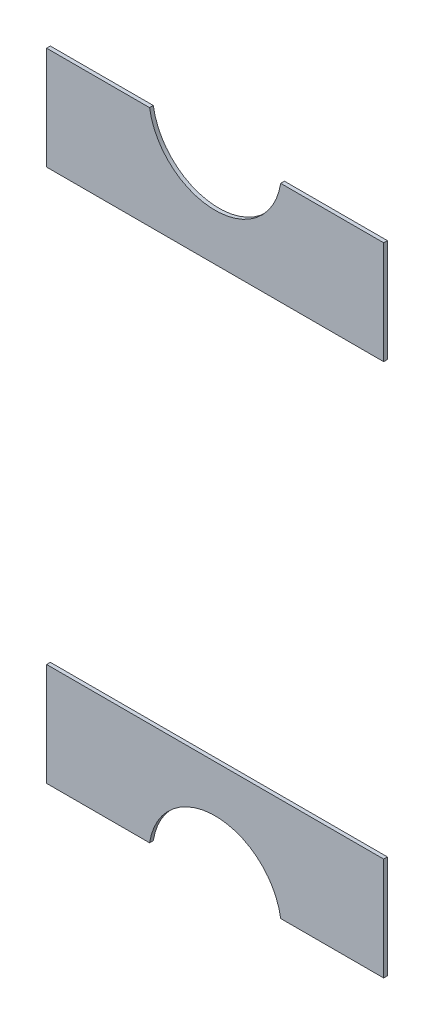
ISO-10303-21;
HEADER;
FILE_DESCRIPTION(('STEP AP214'),'2;1');
FILE_NAME('part.step','',(''),(''),'','','');
FILE_SCHEMA(('AUTOMOTIVE_DESIGN { 1 0 10303 214 1 1 1 1 }'));
ENDSEC;
DATA;
#1=APPLICATION_CONTEXT('core data for automotive mechanical design processes');
#2=APPLICATION_PROTOCOL_DEFINITION('international standard','automotive_design',2000,#1);
#3=PRODUCT_CONTEXT('',#1,'mechanical');
#4=PRODUCT('Part','Part','',(#3));
#5=PRODUCT_RELATED_PRODUCT_CATEGORY('part','',(#4));
#6=PRODUCT_DEFINITION_FORMATION('','',#4);
#7=PRODUCT_DEFINITION_CONTEXT('part definition',#1,'design');
#8=PRODUCT_DEFINITION('design','',#6,#7);
#9=PRODUCT_DEFINITION_SHAPE('','',#8);
#10=(LENGTH_UNIT() NAMED_UNIT(*) SI_UNIT(.MILLI.,.METRE.));
#11=(NAMED_UNIT(*) PLANE_ANGLE_UNIT() SI_UNIT($,.RADIAN.));
#12=(NAMED_UNIT(*) SI_UNIT($,.STERADIAN.) SOLID_ANGLE_UNIT());
#13=UNCERTAINTY_MEASURE_WITH_UNIT(LENGTH_MEASURE(1.E-05),#10,'distance_accuracy_value','');
#14=(GEOMETRIC_REPRESENTATION_CONTEXT(3) GLOBAL_UNCERTAINTY_ASSIGNED_CONTEXT((#13)) GLOBAL_UNIT_ASSIGNED_CONTEXT((#10,
#11,#12)) REPRESENTATION_CONTEXT('',''));
#15=CARTESIAN_POINT('',(0.,0.,0.));
#16=DIRECTION('',(0.,0.,1.));
#17=DIRECTION('',(1.,0.,0.));
#18=AXIS2_PLACEMENT_3D('',#15,#16,#17);
#19=CARTESIAN_POINT('',(-0.175,0.85,0.3));
#20=DIRECTION('',(0.,0.,-1.));
#21=DIRECTION('',(-1.,0.,0.));
#22=AXIS2_PLACEMENT_3D('',#19,#20,#21);
#23=PLANE('',#22);
#24=DIRECTION('',(0.,1.,0.));
#25=VECTOR('',#24,1.);
#26=CARTESIAN_POINT('',(0.45,0.575,0.3));
#27=LINE('',#26,#25);
#28=CARTESIAN_POINT('',(0.45,0.85,0.3));
#29=VERTEX_POINT('',#28);
#30=CARTESIAN_POINT('',(0.45,0.575,0.3));
#31=VERTEX_POINT('',#30);
#32=EDGE_CURVE('P0_E88',#29,#31,#27,.F.);
#33=ORIENTED_EDGE('',*,*,#32,.T.);
#34=DIRECTION('',(1.,0.,0.));
#35=VECTOR('',#34,1.);
#36=CARTESIAN_POINT('',(-0.45,0.575,0.3));
#37=LINE('',#36,#35);
#38=CARTESIAN_POINT('',(-0.45,0.575,0.3));
#39=VERTEX_POINT('',#38);
#40=EDGE_CURVE('P0_E102',#31,#39,#37,.F.);
#41=ORIENTED_EDGE('',*,*,#40,.T.);
#42=DIRECTION('',(0.,1.,0.));
#43=VECTOR('',#42,1.);
#44=CARTESIAN_POINT('',(-0.45,0.85,0.3));
#45=LINE('',#44,#43);
#46=CARTESIAN_POINT('',(-0.45,0.85,0.3));
#47=VERTEX_POINT('',#46);
#48=EDGE_CURVE('P0_E109',#39,#47,#45,.T.);
#49=ORIENTED_EDGE('',*,*,#48,.T.);
#50=DIRECTION('',(1.,0.,0.));
#51=VECTOR('',#50,1.);
#52=CARTESIAN_POINT('',(-0.175,0.85,0.3));
#53=LINE('',#52,#51);
#54=CARTESIAN_POINT('',(-0.174999999999718,0.850000000000022,0.3));
#55=VERTEX_POINT('',#54);
#56=EDGE_CURVE('P0_E66',#47,#55,#53,.T.);
#57=ORIENTED_EDGE('',*,*,#56,.T.);
#58=CARTESIAN_POINT('',(0.,0.877083333333,0.3));
#59=DIRECTION('',(0.,0.,-1.));
#60=DIRECTION('',(-1.,0.,0.));
#61=AXIS2_PLACEMENT_3D('',#58,#59,#60);
#62=CIRCLE('',#61,0.177083333333);
#63=CARTESIAN_POINT('',(0.174999999999857,0.85,0.3));
#64=VERTEX_POINT('',#63);
#65=EDGE_CURVE('P0_E20',#55,#64,#62,.F.);
#66=ORIENTED_EDGE('',*,*,#65,.T.);
#67=DIRECTION('',(1.,0.,0.));
#68=VECTOR('',#67,1.);
#69=CARTESIAN_POINT('',(0.45,0.85,0.3));
#70=LINE('',#69,#68);
#71=EDGE_CURVE('P0_E72',#64,#29,#70,.T.);
#72=ORIENTED_EDGE('',*,*,#71,.T.);
#73=EDGE_LOOP('',(#33,#41,#49,#57,#66,#72));
#74=FACE_BOUND('',#73,.T.);
#75=ADVANCED_FACE('P0_F17',(#74),#23,.T.);
#76=CARTESIAN_POINT('',(-0.175,0.85,0.3));
#77=DIRECTION('',(0.,-1.,0.));
#78=DIRECTION('',(0.,0.,-1.));
#79=AXIS2_PLACEMENT_3D('',#76,#77,#78);
#80=PLANE('',#79);
#81=DIRECTION('',(-1.,0.,0.));
#82=VECTOR('',#81,1.);
#83=CARTESIAN_POINT('',(-0.175,0.85,0.309999999776));
#84=LINE('',#83,#82);
#85=CARTESIAN_POINT('',(-0.45,0.85,0.309999999776));
#86=VERTEX_POINT('',#85);
#87=CARTESIAN_POINT('',(-0.174999999999718,0.850000000000022,0.309999999776));
#88=VERTEX_POINT('',#87);
#89=EDGE_CURVE('P0_E126',#86,#88,#84,.F.);
#90=ORIENTED_EDGE('',*,*,#89,.T.);
#91=DIRECTION('',(0.,0.,-1.));
#92=VECTOR('',#91,1.);
#93=CARTESIAN_POINT('',(-0.174999999999721,0.850000000000043,0.3));
#94=LINE('',#93,#92);
#95=EDGE_CURVE('P0_E83',#88,#55,#94,.T.);
#96=ORIENTED_EDGE('',*,*,#95,.T.);
#97=ORIENTED_EDGE('',*,*,#56,.F.);
#98=DIRECTION('',(0.,0.,-1.));
#99=VECTOR('',#98,1.);
#100=CARTESIAN_POINT('',(-0.45,0.85,0.3));
#101=LINE('',#100,#99);
#102=EDGE_CURVE('P0_E106',#47,#86,#101,.F.);
#103=ORIENTED_EDGE('',*,*,#102,.T.);
#104=EDGE_LOOP('',(#90,#96,#97,#103));
#105=FACE_BOUND('',#104,.T.);
#106=ADVANCED_FACE('P0_F153',(#105),#80,.F.);
#107=CARTESIAN_POINT('',(0.,0.877083333333,0.3));
#108=DIRECTION('',(0.,0.,-1.));
#109=DIRECTION('',(-1.,0.,0.));
#110=AXIS2_PLACEMENT_3D('',#107,#108,#109);
#111=CYLINDRICAL_SURFACE('',#110,0.177083333333);
#112=ORIENTED_EDGE('',*,*,#65,.F.);
#113=ORIENTED_EDGE('',*,*,#95,.F.);
#114=CARTESIAN_POINT('',(0.,0.877083333333,0.309999999776));
#115=DIRECTION('',(0.,0.,-1.));
#116=DIRECTION('',(-1.,0.,0.));
#117=AXIS2_PLACEMENT_3D('',#114,#115,#116);
#118=CIRCLE('',#117,0.177083333333);
#119=CARTESIAN_POINT('',(0.174999999999857,0.85,0.309999999776));
#120=VERTEX_POINT('',#119);
#121=EDGE_CURVE('P0_E87',#88,#120,#118,.F.);
#122=ORIENTED_EDGE('',*,*,#121,.T.);
#123=DIRECTION('',(0.,0.,-1.));
#124=VECTOR('',#123,1.);
#125=CARTESIAN_POINT('',(0.175,0.85,0.3));
#126=LINE('',#125,#124);
#127=EDGE_CURVE('P0_E76',#120,#64,#126,.T.);
#128=ORIENTED_EDGE('',*,*,#127,.T.);
#129=EDGE_LOOP('',(#112,#113,#122,#128));
#130=FACE_BOUND('',#129,.T.);
#131=ADVANCED_FACE('P0_F85',(#130),#111,.F.);
#132=CARTESIAN_POINT('',(0.45,0.85,0.3));
#133=DIRECTION('',(0.,-1.,0.));
#134=DIRECTION('',(0.,0.,-1.));
#135=AXIS2_PLACEMENT_3D('',#132,#133,#134);
#136=PLANE('',#135);
#137=DIRECTION('',(-1.,0.,0.));
#138=VECTOR('',#137,1.);
#139=CARTESIAN_POINT('',(-0.175,0.85,0.309999999776));
#140=LINE('',#139,#138);
#141=CARTESIAN_POINT('',(0.45,0.85,0.309999999776));
#142=VERTEX_POINT('',#141);
#143=EDGE_CURVE('P0_E98',#120,#142,#140,.F.);
#144=ORIENTED_EDGE('',*,*,#143,.T.);
#145=DIRECTION('',(0.,0.,1.));
#146=VECTOR('',#145,1.);
#147=CARTESIAN_POINT('',(0.45,0.85,0.3));
#148=LINE('',#147,#146);
#149=EDGE_CURVE('P0_E78',#142,#29,#148,.F.);
#150=ORIENTED_EDGE('',*,*,#149,.T.);
#151=ORIENTED_EDGE('',*,*,#71,.F.);
#152=ORIENTED_EDGE('',*,*,#127,.F.);
#153=EDGE_LOOP('',(#144,#150,#151,#152));
#154=FACE_BOUND('',#153,.T.);
#155=ADVANCED_FACE('P0_F74',(#154),#136,.F.);
#156=CARTESIAN_POINT('',(0.45,0.575,0.3));
#157=DIRECTION('',(-1.,0.,0.));
#158=DIRECTION('',(0.,0.,1.));
#159=AXIS2_PLACEMENT_3D('',#156,#157,#158);
#160=PLANE('',#159);
#161=DIRECTION('',(0.,1.,0.));
#162=VECTOR('',#161,1.);
#163=CARTESIAN_POINT('',(0.45,0.85,0.309999999776));
#164=LINE('',#163,#162);
#165=CARTESIAN_POINT('',(0.45,0.575,0.309999999776));
#166=VERTEX_POINT('',#165);
#167=EDGE_CURVE('P0_E95',#142,#166,#164,.F.);
#168=ORIENTED_EDGE('',*,*,#167,.T.);
#169=DIRECTION('',(0.,0.,1.));
#170=VECTOR('',#169,1.);
#171=CARTESIAN_POINT('',(0.45,0.575,0.3));
#172=LINE('',#171,#170);
#173=EDGE_CURVE('P0_E118',#166,#31,#172,.F.);
#174=ORIENTED_EDGE('',*,*,#173,.T.);
#175=ORIENTED_EDGE('',*,*,#32,.F.);
#176=ORIENTED_EDGE('',*,*,#149,.F.);
#177=EDGE_LOOP('',(#168,#174,#175,#176));
#178=FACE_BOUND('',#177,.T.);
#179=ADVANCED_FACE('P0_F150',(#178),#160,.F.);
#180=CARTESIAN_POINT('',(-0.45,0.575,0.3));
#181=DIRECTION('',(0.,1.,0.));
#182=DIRECTION('',(0.,0.,1.));
#183=AXIS2_PLACEMENT_3D('',#180,#181,#182);
#184=PLANE('',#183);
#185=DIRECTION('',(-1.,0.,0.));
#186=VECTOR('',#185,1.);
#187=CARTESIAN_POINT('',(-0.175,0.575,0.309999999776));
#188=LINE('',#187,#186);
#189=CARTESIAN_POINT('',(-0.45,0.575,0.309999999776));
#190=VERTEX_POINT('',#189);
#191=EDGE_CURVE('P0_E26',#166,#190,#188,.T.);
#192=ORIENTED_EDGE('',*,*,#191,.T.);
#193=DIRECTION('',(0.,0.,-1.));
#194=VECTOR('',#193,1.);
#195=CARTESIAN_POINT('',(-0.45,0.575,0.3));
#196=LINE('',#195,#194);
#197=EDGE_CURVE('P0_E34',#190,#39,#196,.T.);
#198=ORIENTED_EDGE('',*,*,#197,.T.);
#199=ORIENTED_EDGE('',*,*,#40,.F.);
#200=ORIENTED_EDGE('',*,*,#173,.F.);
#201=EDGE_LOOP('',(#192,#198,#199,#200));
#202=FACE_BOUND('',#201,.T.);
#203=ADVANCED_FACE('P0_F145',(#202),#184,.F.);
#204=CARTESIAN_POINT('',(-0.45,0.85,0.3));
#205=DIRECTION('',(1.,0.,0.));
#206=DIRECTION('',(0.,0.,-1.));
#207=AXIS2_PLACEMENT_3D('',#204,#205,#206);
#208=PLANE('',#207);
#209=DIRECTION('',(0.,1.,0.));
#210=VECTOR('',#209,1.);
#211=CARTESIAN_POINT('',(-0.45,0.85,0.309999999776));
#212=LINE('',#211,#210);
#213=EDGE_CURVE('P0_E11',#190,#86,#212,.T.);
#214=ORIENTED_EDGE('',*,*,#213,.T.);
#215=ORIENTED_EDGE('',*,*,#102,.F.);
#216=ORIENTED_EDGE('',*,*,#48,.F.);
#217=ORIENTED_EDGE('',*,*,#197,.F.);
#218=EDGE_LOOP('',(#214,#215,#216,#217));
#219=FACE_BOUND('',#218,.T.);
#220=ADVANCED_FACE('P0_F152',(#219),#208,.F.);
#221=CARTESIAN_POINT('',(-0.175,0.85,0.309999999776));
#222=DIRECTION('',(0.,0.,-1.));
#223=DIRECTION('',(-1.,0.,0.));
#224=AXIS2_PLACEMENT_3D('',#221,#222,#223);
#225=PLANE('',#224);
#226=ORIENTED_EDGE('',*,*,#191,.F.);
#227=ORIENTED_EDGE('',*,*,#167,.F.);
#228=ORIENTED_EDGE('',*,*,#143,.F.);
#229=ORIENTED_EDGE('',*,*,#121,.F.);
#230=ORIENTED_EDGE('',*,*,#89,.F.);
#231=ORIENTED_EDGE('',*,*,#213,.F.);
#232=EDGE_LOOP('',(#226,#227,#228,#229,#230,#231));
#233=FACE_BOUND('',#232,.T.);
#234=ADVANCED_FACE('P0_F148',(#233),#225,.F.);
#235=CLOSED_SHELL('',(#75,#106,#131,#155,#179,#203,#220,#234));
#236=MANIFOLD_SOLID_BREP('P0_B1',#235);
#237=CARTESIAN_POINT('',(-0.45,-0.85,0.309999999776));
#238=DIRECTION('',(0.,0.,1.));
#239=DIRECTION('',(1.,0.,0.));
#240=AXIS2_PLACEMENT_3D('',#237,#238,#239);
#241=PLANE('',#240);
#242=DIRECTION('',(1.,0.,0.));
#243=VECTOR('',#242,1.);
#244=CARTESIAN_POINT('',(0.45,-0.85,0.309999999776));
#245=LINE('',#244,#243);
#246=CARTESIAN_POINT('',(0.45,-0.85,0.309999999776));
#247=VERTEX_POINT('',#246);
#248=CARTESIAN_POINT('',(0.174999999999857,-0.85,0.309999999776));
#249=VERTEX_POINT('',#248);
#250=EDGE_CURVE('P1_E70',#247,#249,#245,.F.);
#251=ORIENTED_EDGE('',*,*,#250,.F.);
#252=DIRECTION('',(0.,1.,0.));
#253=VECTOR('',#252,1.);
#254=CARTESIAN_POINT('',(0.45,-0.575,0.309999999776));
#255=LINE('',#254,#253);
#256=CARTESIAN_POINT('',(0.45,-0.575,0.309999999776));
#257=VERTEX_POINT('',#256);
#258=EDGE_CURVE('P1_E99',#257,#247,#255,.F.);
#259=ORIENTED_EDGE('',*,*,#258,.F.);
#260=DIRECTION('',(1.,0.,0.));
#261=VECTOR('',#260,1.);
#262=CARTESIAN_POINT('',(-0.45,-0.575,0.309999999776));
#263=LINE('',#262,#261);
#264=CARTESIAN_POINT('',(-0.45,-0.575,0.309999999776));
#265=VERTEX_POINT('',#264);
#266=EDGE_CURVE('P1_E111',#265,#257,#263,.T.);
#267=ORIENTED_EDGE('',*,*,#266,.F.);
#268=DIRECTION('',(0.,1.,0.));
#269=VECTOR('',#268,1.);
#270=CARTESIAN_POINT('',(-0.45,-0.85,0.309999999776));
#271=LINE('',#270,#269);
#272=CARTESIAN_POINT('',(-0.45,-0.85,0.309999999776));
#273=VERTEX_POINT('',#272);
#274=EDGE_CURVE('P1_E104',#273,#265,#271,.T.);
#275=ORIENTED_EDGE('',*,*,#274,.F.);
#276=DIRECTION('',(1.,0.,0.));
#277=VECTOR('',#276,1.);
#278=CARTESIAN_POINT('',(-0.175,-0.85,0.309999999776));
#279=LINE('',#278,#277);
#280=CARTESIAN_POINT('',(-0.174999999999718,-0.850000000000022,0.309999999776));
#281=VERTEX_POINT('',#280);
#282=EDGE_CURVE('P1_E73',#281,#273,#279,.F.);
#283=ORIENTED_EDGE('',*,*,#282,.F.);
#284=CARTESIAN_POINT('',(0.,-0.877083333333,0.309999999776));
#285=DIRECTION('',(0.,0.,-1.));
#286=DIRECTION('',(-1.,0.,0.));
#287=AXIS2_PLACEMENT_3D('',#284,#285,#286);
#288=CIRCLE('',#287,0.177083333333);
#289=EDGE_CURVE('P1_E20',#281,#249,#288,.T.);
#290=ORIENTED_EDGE('',*,*,#289,.T.);
#291=EDGE_LOOP('',(#251,#259,#267,#275,#283,#290));
#292=FACE_BOUND('',#291,.T.);
#293=ADVANCED_FACE('P1_F17',(#292),#241,.T.);
#294=CARTESIAN_POINT('',(-0.45,-0.85,0.3));
#295=DIRECTION('',(-1.,0.,0.));
#296=DIRECTION('',(0.,0.,1.));
#297=AXIS2_PLACEMENT_3D('',#294,#295,#296);
#298=PLANE('',#297);
#299=DIRECTION('',(0.,0.,-1.));
#300=VECTOR('',#299,1.);
#301=CARTESIAN_POINT('',(-0.45,-0.85,0.3));
#302=LINE('',#301,#300);
#303=CARTESIAN_POINT('',(-0.45,-0.85,0.3));
#304=VERTEX_POINT('',#303);
#305=EDGE_CURVE('P1_E102',#273,#304,#302,.T.);
#306=ORIENTED_EDGE('',*,*,#305,.F.);
#307=ORIENTED_EDGE('',*,*,#274,.T.);
#308=DIRECTION('',(0.,0.,1.));
#309=VECTOR('',#308,1.);
#310=CARTESIAN_POINT('',(-0.45,-0.575,0.3));
#311=LINE('',#310,#309);
#312=CARTESIAN_POINT('',(-0.45,-0.575,0.3));
#313=VERTEX_POINT('',#312);
#314=EDGE_CURVE('P1_E114',#313,#265,#311,.T.);
#315=ORIENTED_EDGE('',*,*,#314,.F.);
#316=DIRECTION('',(0.,1.,0.));
#317=VECTOR('',#316,1.);
#318=CARTESIAN_POINT('',(-0.45,-0.85,0.3));
#319=LINE('',#318,#317);
#320=EDGE_CURVE('P1_E107',#313,#304,#319,.F.);
#321=ORIENTED_EDGE('',*,*,#320,.T.);
#322=EDGE_LOOP('',(#306,#307,#315,#321));
#323=FACE_BOUND('',#322,.T.);
#324=ADVANCED_FACE('P1_F149',(#323),#298,.T.);
#325=CARTESIAN_POINT('',(-0.175,-0.85,0.3));
#326=DIRECTION('',(0.,-1.,0.));
#327=DIRECTION('',(0.,0.,-1.));
#328=AXIS2_PLACEMENT_3D('',#325,#326,#327);
#329=PLANE('',#328);
#330=DIRECTION('',(0.,0.,-1.));
#331=VECTOR('',#330,1.);
#332=CARTESIAN_POINT('',(-0.174999999999721,-0.850000000000043,0.3));
#333=LINE('',#332,#331);
#334=CARTESIAN_POINT('',(-0.174999999999718,-0.850000000000022,0.3));
#335=VERTEX_POINT('',#334);
#336=EDGE_CURVE('P1_E75',#335,#281,#333,.F.);
#337=ORIENTED_EDGE('',*,*,#336,.T.);
#338=ORIENTED_EDGE('',*,*,#282,.T.);
#339=ORIENTED_EDGE('',*,*,#305,.T.);
#340=DIRECTION('',(1.,0.,0.));
#341=VECTOR('',#340,1.);
#342=CARTESIAN_POINT('',(-0.45,-0.85,0.3));
#343=LINE('',#342,#341);
#344=EDGE_CURVE('P1_E110',#304,#335,#343,.T.);
#345=ORIENTED_EDGE('',*,*,#344,.T.);
#346=EDGE_LOOP('',(#337,#338,#339,#345));
#347=FACE_BOUND('',#346,.T.);
#348=ADVANCED_FACE('P1_F142',(#347),#329,.T.);
#349=CARTESIAN_POINT('',(0.,-0.877083333333,0.3));
#350=DIRECTION('',(0.,0.,-1.));
#351=DIRECTION('',(-1.,0.,0.));
#352=AXIS2_PLACEMENT_3D('',#349,#350,#351);
#353=CYLINDRICAL_SURFACE('',#352,0.177083333333);
#354=CARTESIAN_POINT('',(0.,-0.877083333333,0.3));
#355=DIRECTION('',(0.,0.,-1.));
#356=DIRECTION('',(-1.,0.,0.));
#357=AXIS2_PLACEMENT_3D('',#354,#355,#356);
#358=CIRCLE('',#357,0.177083333333);
#359=CARTESIAN_POINT('',(0.174999999999857,-0.85,0.3));
#360=VERTEX_POINT('',#359);
#361=EDGE_CURVE('P1_E87',#335,#360,#358,.T.);
#362=ORIENTED_EDGE('',*,*,#361,.T.);
#363=DIRECTION('',(0.,0.,-1.));
#364=VECTOR('',#363,1.);
#365=CARTESIAN_POINT('',(0.175,-0.85,0.3));
#366=LINE('',#365,#364);
#367=EDGE_CURVE('P1_E80',#249,#360,#366,.T.);
#368=ORIENTED_EDGE('',*,*,#367,.F.);
#369=ORIENTED_EDGE('',*,*,#289,.F.);
#370=ORIENTED_EDGE('',*,*,#336,.F.);
#371=EDGE_LOOP('',(#362,#368,#369,#370));
#372=FACE_BOUND('',#371,.T.);
#373=ADVANCED_FACE('P1_F85',(#372),#353,.F.);
#374=CARTESIAN_POINT('',(0.45,-0.85,0.3));
#375=DIRECTION('',(0.,-1.,0.));
#376=DIRECTION('',(0.,0.,-1.));
#377=AXIS2_PLACEMENT_3D('',#374,#375,#376);
#378=PLANE('',#377);
#379=DIRECTION('',(0.,0.,-1.));
#380=VECTOR('',#379,1.);
#381=CARTESIAN_POINT('',(0.45,-0.85,0.3));
#382=LINE('',#381,#380);
#383=CARTESIAN_POINT('',(0.45,-0.85,0.3));
#384=VERTEX_POINT('',#383);
#385=EDGE_CURVE('P1_E82',#247,#384,#382,.T.);
#386=ORIENTED_EDGE('',*,*,#385,.F.);
#387=ORIENTED_EDGE('',*,*,#250,.T.);
#388=ORIENTED_EDGE('',*,*,#367,.T.);
#389=DIRECTION('',(1.,0.,0.));
#390=VECTOR('',#389,1.);
#391=CARTESIAN_POINT('',(-0.45,-0.85,0.3));
#392=LINE('',#391,#390);
#393=EDGE_CURVE('P1_E95',#360,#384,#392,.T.);
#394=ORIENTED_EDGE('',*,*,#393,.T.);
#395=EDGE_LOOP('',(#386,#387,#388,#394));
#396=FACE_BOUND('',#395,.T.);
#397=ADVANCED_FACE('P1_F78',(#396),#378,.T.);
#398=CARTESIAN_POINT('',(0.45,-0.575,0.3));
#399=DIRECTION('',(1.,0.,0.));
#400=DIRECTION('',(0.,0.,-1.));
#401=AXIS2_PLACEMENT_3D('',#398,#399,#400);
#402=PLANE('',#401);
#403=DIRECTION('',(0.,0.,1.));
#404=VECTOR('',#403,1.);
#405=CARTESIAN_POINT('',(0.45,-0.575,0.3));
#406=LINE('',#405,#404);
#407=CARTESIAN_POINT('',(0.45,-0.575,0.3));
#408=VERTEX_POINT('',#407);
#409=EDGE_CURVE('P1_E34',#257,#408,#406,.F.);
#410=ORIENTED_EDGE('',*,*,#409,.F.);
#411=ORIENTED_EDGE('',*,*,#258,.T.);
#412=ORIENTED_EDGE('',*,*,#385,.T.);
#413=DIRECTION('',(0.,1.,0.));
#414=VECTOR('',#413,1.);
#415=CARTESIAN_POINT('',(0.45,-0.85,0.3));
#416=LINE('',#415,#414);
#417=EDGE_CURVE('P1_E26',#384,#408,#416,.T.);
#418=ORIENTED_EDGE('',*,*,#417,.T.);
#419=EDGE_LOOP('',(#410,#411,#412,#418));
#420=FACE_BOUND('',#419,.T.);
#421=ADVANCED_FACE('P1_F153',(#420),#402,.T.);
#422=CARTESIAN_POINT('',(-0.45,-0.575,0.3));
#423=DIRECTION('',(0.,1.,0.));
#424=DIRECTION('',(0.,0.,1.));
#425=AXIS2_PLACEMENT_3D('',#422,#423,#424);
#426=PLANE('',#425);
#427=ORIENTED_EDGE('',*,*,#314,.T.);
#428=ORIENTED_EDGE('',*,*,#266,.T.);
#429=ORIENTED_EDGE('',*,*,#409,.T.);
#430=DIRECTION('',(1.,0.,0.));
#431=VECTOR('',#430,1.);
#432=CARTESIAN_POINT('',(-0.45,-0.575,0.3));
#433=LINE('',#432,#431);
#434=EDGE_CURVE('P1_E11',#408,#313,#433,.F.);
#435=ORIENTED_EDGE('',*,*,#434,.T.);
#436=EDGE_LOOP('',(#427,#428,#429,#435));
#437=FACE_BOUND('',#436,.T.);
#438=ADVANCED_FACE('P1_F151',(#437),#426,.T.);
#439=CARTESIAN_POINT('',(-0.45,-0.85,0.3));
#440=DIRECTION('',(0.,0.,1.));
#441=DIRECTION('',(1.,0.,0.));
#442=AXIS2_PLACEMENT_3D('',#439,#440,#441);
#443=PLANE('',#442);
#444=ORIENTED_EDGE('',*,*,#417,.F.);
#445=ORIENTED_EDGE('',*,*,#393,.F.);
#446=ORIENTED_EDGE('',*,*,#361,.F.);
#447=ORIENTED_EDGE('',*,*,#344,.F.);
#448=ORIENTED_EDGE('',*,*,#320,.F.);
#449=ORIENTED_EDGE('',*,*,#434,.F.);
#450=EDGE_LOOP('',(#444,#445,#446,#447,#448,#449));
#451=FACE_BOUND('',#450,.T.);
#452=ADVANCED_FACE('P1_F146',(#451),#443,.F.);
#453=CLOSED_SHELL('',(#293,#324,#348,#373,#397,#421,#438,#452));
#454=MANIFOLD_SOLID_BREP('P1_B1',#453);
#455=ADVANCED_BREP_SHAPE_REPRESENTATION('',(#18,#236,#454),#14);
#456=SHAPE_DEFINITION_REPRESENTATION(#9,#455);
ENDSEC;
END-ISO-10303-21;
